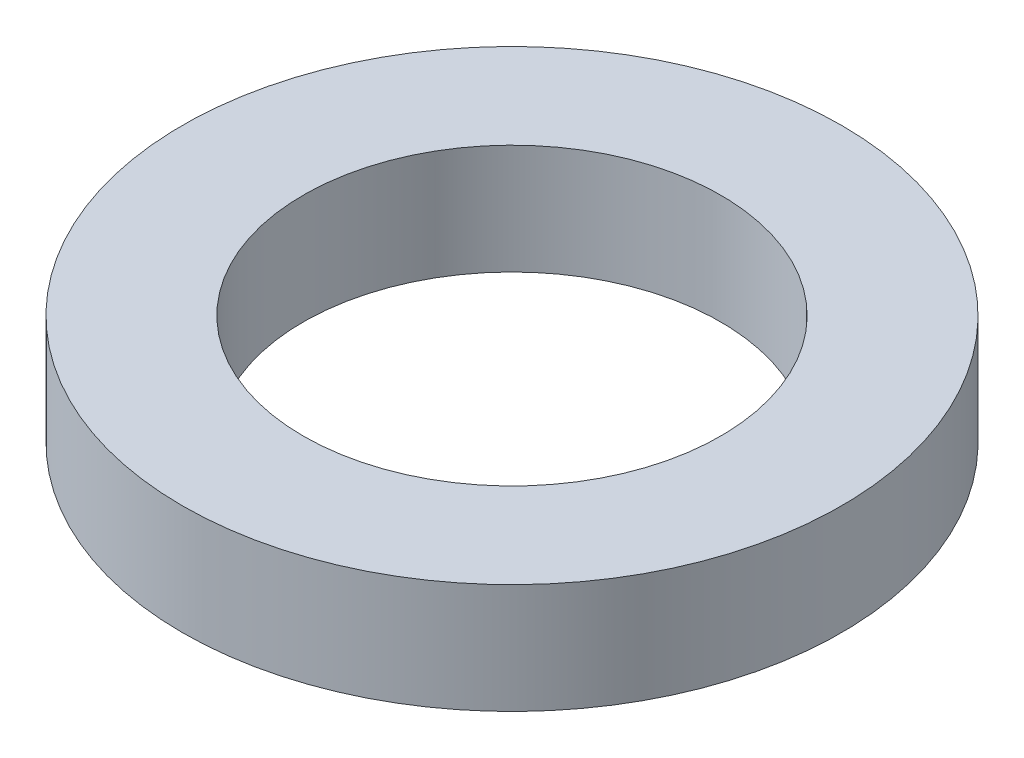
ISO-10303-21;
HEADER;
FILE_DESCRIPTION(('STEP AP214'),'2;1');
FILE_NAME('part.step','',(''),(''),'','','');
FILE_SCHEMA(('AUTOMOTIVE_DESIGN { 1 0 10303 214 1 1 1 1 }'));
ENDSEC;
DATA;
#1=APPLICATION_CONTEXT('core data for automotive mechanical design processes');
#2=APPLICATION_PROTOCOL_DEFINITION('international standard','automotive_design',2000,#1);
#3=PRODUCT_CONTEXT('',#1,'mechanical');
#4=PRODUCT('Part','Part','',(#3));
#5=PRODUCT_RELATED_PRODUCT_CATEGORY('part','',(#4));
#6=PRODUCT_DEFINITION_FORMATION('','',#4);
#7=PRODUCT_DEFINITION_CONTEXT('part definition',#1,'design');
#8=PRODUCT_DEFINITION('design','',#6,#7);
#9=PRODUCT_DEFINITION_SHAPE('','',#8);
#10=(LENGTH_UNIT() NAMED_UNIT(*) SI_UNIT(.MILLI.,.METRE.));
#11=(NAMED_UNIT(*) PLANE_ANGLE_UNIT() SI_UNIT($,.RADIAN.));
#12=(NAMED_UNIT(*) SI_UNIT($,.STERADIAN.) SOLID_ANGLE_UNIT());
#13=UNCERTAINTY_MEASURE_WITH_UNIT(LENGTH_MEASURE(1.E-05),#10,'distance_accuracy_value','');
#14=(GEOMETRIC_REPRESENTATION_CONTEXT(3) GLOBAL_UNCERTAINTY_ASSIGNED_CONTEXT((#13)) GLOBAL_UNIT_ASSIGNED_CONTEXT((#10,
#11,#12)) REPRESENTATION_CONTEXT('',''));
#15=CARTESIAN_POINT('',(0.,0.,0.));
#16=DIRECTION('',(0.,0.,1.));
#17=DIRECTION('',(1.,0.,0.));
#18=AXIS2_PLACEMENT_3D('',#15,#16,#17);
#19=CARTESIAN_POINT('',(0.,0.5,0.));
#20=DIRECTION('',(0.,1.,0.));
#21=DIRECTION('',(0.,0.,1.));
#22=AXIS2_PLACEMENT_3D('',#19,#20,#21);
#23=PLANE('',#22);
#24=CARTESIAN_POINT('',(0.,0.5,0.));
#25=DIRECTION('',(0.,1.,0.));
#26=DIRECTION('',(0.,0.,1.));
#27=AXIS2_PLACEMENT_3D('',#24,#25,#26);
#28=CIRCLE('',#27,3.);
#29=CARTESIAN_POINT('',(0.,0.5,3.));
#30=VERTEX_POINT('',#29);
#31=EDGE_CURVE('E10',#30,#30,#28,.T.);
#32=ORIENTED_EDGE('',*,*,#31,.T.);
#33=EDGE_LOOP('',(#32));
#34=FACE_BOUND('',#33,.T.);
#35=CARTESIAN_POINT('',(0.,0.5,0.));
#36=DIRECTION('',(0.,1.,0.));
#37=DIRECTION('',(0.,0.,1.));
#38=AXIS2_PLACEMENT_3D('',#35,#36,#37);
#39=CIRCLE('',#38,1.9);
#40=CARTESIAN_POINT('',(0.,0.5,1.9));
#41=VERTEX_POINT('',#40);
#42=EDGE_CURVE('E42',#41,#41,#39,.T.);
#43=ORIENTED_EDGE('',*,*,#42,.F.);
#44=EDGE_LOOP('',(#43));
#45=FACE_BOUND('',#44,.T.);
#46=ADVANCED_FACE('F31',(#34,#45),#23,.T.);
#47=CARTESIAN_POINT('',(0.,-0.5,0.));
#48=DIRECTION('',(0.,1.,0.));
#49=DIRECTION('',(0.,0.,1.));
#50=AXIS2_PLACEMENT_3D('',#47,#48,#49);
#51=PLANE('',#50);
#52=CARTESIAN_POINT('',(0.,-0.5,0.));
#53=DIRECTION('',(0.,1.,0.));
#54=DIRECTION('',(0.,0.,1.));
#55=AXIS2_PLACEMENT_3D('',#52,#53,#54);
#56=CIRCLE('',#55,3.);
#57=CARTESIAN_POINT('',(0.,-0.5,3.));
#58=VERTEX_POINT('',#57);
#59=EDGE_CURVE('E35',#58,#58,#56,.T.);
#60=ORIENTED_EDGE('',*,*,#59,.F.);
#61=EDGE_LOOP('',(#60));
#62=FACE_BOUND('',#61,.T.);
#63=CARTESIAN_POINT('',(0.,-0.5,0.));
#64=DIRECTION('',(0.,1.,0.));
#65=DIRECTION('',(0.,0.,1.));
#66=AXIS2_PLACEMENT_3D('',#63,#64,#65);
#67=CIRCLE('',#66,1.9);
#68=CARTESIAN_POINT('',(0.,-0.5,1.9));
#69=VERTEX_POINT('',#68);
#70=EDGE_CURVE('E44',#69,#69,#67,.T.);
#71=ORIENTED_EDGE('',*,*,#70,.T.);
#72=EDGE_LOOP('',(#71));
#73=FACE_BOUND('',#72,.T.);
#74=ADVANCED_FACE('F54',(#62,#73),#51,.F.);
#75=CARTESIAN_POINT('',(0.,0.5,0.));
#76=DIRECTION('',(0.,-1.,0.));
#77=DIRECTION('',(0.,0.,-1.));
#78=AXIS2_PLACEMENT_3D('',#75,#76,#77);
#79=CYLINDRICAL_SURFACE('',#78,3.);
#80=ORIENTED_EDGE('',*,*,#31,.F.);
#81=EDGE_LOOP('',(#80));
#82=FACE_BOUND('',#81,.T.);
#83=ORIENTED_EDGE('',*,*,#59,.T.);
#84=EDGE_LOOP('',(#83));
#85=FACE_BOUND('',#84,.T.);
#86=ADVANCED_FACE('F33',(#82,#85),#79,.T.);
#87=CARTESIAN_POINT('',(0.,0.5,0.));
#88=DIRECTION('',(0.,-1.,0.));
#89=DIRECTION('',(0.,0.,-1.));
#90=AXIS2_PLACEMENT_3D('',#87,#88,#89);
#91=CYLINDRICAL_SURFACE('',#90,1.9);
#92=ORIENTED_EDGE('',*,*,#42,.T.);
#93=EDGE_LOOP('',(#92));
#94=FACE_BOUND('',#93,.T.);
#95=ORIENTED_EDGE('',*,*,#70,.F.);
#96=EDGE_LOOP('',(#95));
#97=FACE_BOUND('',#96,.T.);
#98=ADVANCED_FACE('F50',(#94,#97),#91,.F.);
#99=CLOSED_SHELL('',(#46,#74,#86,#98));
#100=MANIFOLD_SOLID_BREP('B2',#99);
#101=ADVANCED_BREP_SHAPE_REPRESENTATION('',(#18,#100),#14);
#102=SHAPE_DEFINITION_REPRESENTATION(#9,#101);
ENDSEC;
END-ISO-10303-21;
